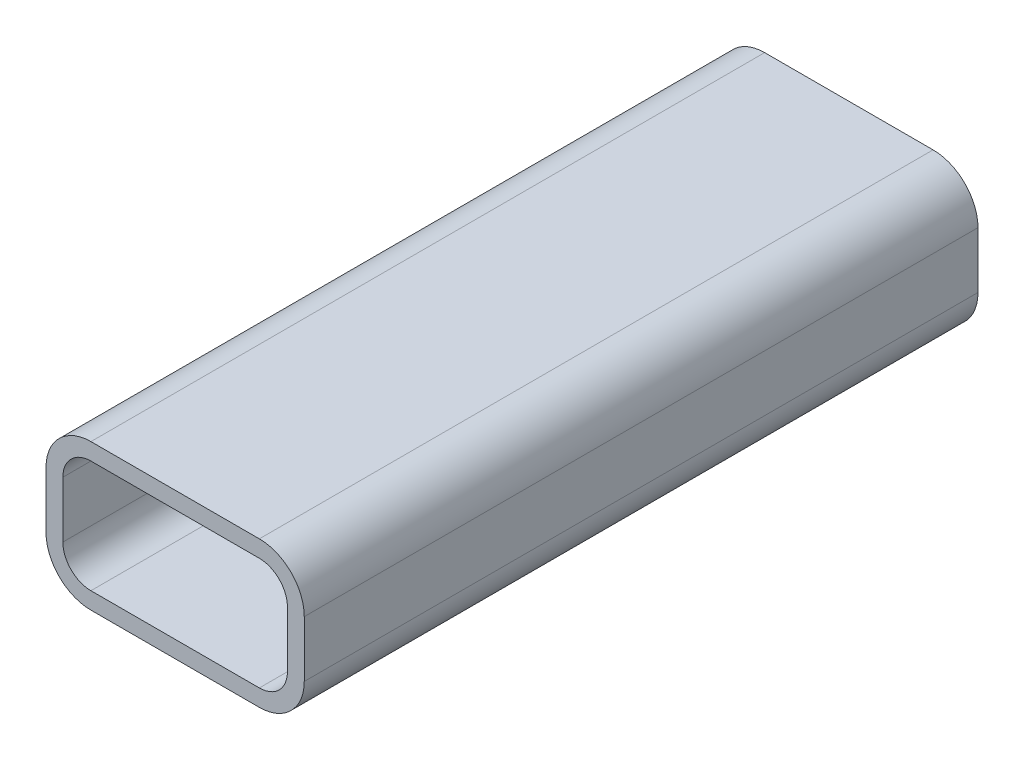
ISO-10303-21;
HEADER;
FILE_DESCRIPTION(('STEP AP214'),'2;1');
FILE_NAME('part.step','',(''),(''),'','','');
FILE_SCHEMA(('AUTOMOTIVE_DESIGN { 1 0 10303 214 1 1 1 1 }'));
ENDSEC;
DATA;
#1=APPLICATION_CONTEXT('core data for automotive mechanical design processes');
#2=APPLICATION_PROTOCOL_DEFINITION('international standard','automotive_design',2000,#1);
#3=PRODUCT_CONTEXT('',#1,'mechanical');
#4=PRODUCT('Part','Part','',(#3));
#5=PRODUCT_RELATED_PRODUCT_CATEGORY('part','',(#4));
#6=PRODUCT_DEFINITION_FORMATION('','',#4);
#7=PRODUCT_DEFINITION_CONTEXT('part definition',#1,'design');
#8=PRODUCT_DEFINITION('design','',#6,#7);
#9=PRODUCT_DEFINITION_SHAPE('','',#8);
#10=(LENGTH_UNIT() NAMED_UNIT(*) SI_UNIT(.MILLI.,.METRE.));
#11=(NAMED_UNIT(*) PLANE_ANGLE_UNIT() SI_UNIT($,.RADIAN.));
#12=(NAMED_UNIT(*) SI_UNIT($,.STERADIAN.) SOLID_ANGLE_UNIT());
#13=UNCERTAINTY_MEASURE_WITH_UNIT(LENGTH_MEASURE(1.E-05),#10,'distance_accuracy_value','');
#14=(GEOMETRIC_REPRESENTATION_CONTEXT(3) GLOBAL_UNCERTAINTY_ASSIGNED_CONTEXT((#13)) GLOBAL_UNIT_ASSIGNED_CONTEXT((#10,
#11,#12)) REPRESENTATION_CONTEXT('',''));
#15=CARTESIAN_POINT('',(0.,0.,0.));
#16=DIRECTION('',(0.,0.,1.));
#17=DIRECTION('',(1.,0.,0.));
#18=AXIS2_PLACEMENT_3D('',#15,#16,#17);
#19=CARTESIAN_POINT('',(24.0517051008152,-14.0517051008152,60.));
#20=DIRECTION('',(0.,0.,1.));
#21=DIRECTION('',(1.,0.,0.));
#22=AXIS2_PLACEMENT_3D('',#19,#20,#21);
#23=PLANE('',#22);
#24=CARTESIAN_POINT('',(24.0517051008152,-14.0517051008152,60.));
#25=DIRECTION('',(0.,0.,1.));
#26=DIRECTION('',(1.,0.,0.));
#27=AXIS2_PLACEMENT_3D('',#24,#25,#26);
#28=CIRCLE('',#27,7.99999999999999);
#29=CARTESIAN_POINT('',(24.0517051008152,-22.0517051008152,60.));
#30=VERTEX_POINT('',#29);
#31=CARTESIAN_POINT('',(32.0517051008152,-14.0517051008152,60.));
#32=VERTEX_POINT('',#31);
#33=EDGE_CURVE('E290',#30,#32,#28,.T.);
#34=ORIENTED_EDGE('',*,*,#33,.T.);
#35=DIRECTION('',(0.,1.,0.));
#36=VECTOR('',#35,1.);
#37=CARTESIAN_POINT('',(32.0517051008152,-4.05170510081523,60.));
#38=LINE('',#37,#36);
#39=CARTESIAN_POINT('',(32.0517051008152,-4.05170510081523,60.));
#40=VERTEX_POINT('',#39);
#41=EDGE_CURVE('E294',#32,#40,#38,.T.);
#42=ORIENTED_EDGE('',*,*,#41,.T.);
#43=CARTESIAN_POINT('',(24.0517051008152,-4.05170510081523,60.));
#44=DIRECTION('',(0.,0.,1.));
#45=DIRECTION('',(1.,0.,0.));
#46=AXIS2_PLACEMENT_3D('',#43,#44,#45);
#47=CIRCLE('',#46,8.);
#48=CARTESIAN_POINT('',(24.0517051008152,3.94829489918477,60.));
#49=VERTEX_POINT('',#48);
#50=EDGE_CURVE('E298',#40,#49,#47,.T.);
#51=ORIENTED_EDGE('',*,*,#50,.T.);
#52=DIRECTION('',(-1.,0.,0.));
#53=VECTOR('',#52,1.);
#54=CARTESIAN_POINT('',(-5.94829489918482,3.94829489918477,60.));
#55=LINE('',#54,#53);
#56=CARTESIAN_POINT('',(-5.94829489918482,3.94829489918477,60.));
#57=VERTEX_POINT('',#56);
#58=EDGE_CURVE('E301',#49,#57,#55,.T.);
#59=ORIENTED_EDGE('',*,*,#58,.T.);
#60=CARTESIAN_POINT('',(-5.94829489918482,-4.05170510081523,60.));
#61=DIRECTION('',(0.,0.,1.));
#62=DIRECTION('',(1.,0.,0.));
#63=AXIS2_PLACEMENT_3D('',#60,#61,#62);
#64=CIRCLE('',#63,8.);
#65=CARTESIAN_POINT('',(-13.9482948991848,-4.05170510081523,60.));
#66=VERTEX_POINT('',#65);
#67=EDGE_CURVE('E304',#57,#66,#64,.T.);
#68=ORIENTED_EDGE('',*,*,#67,.T.);
#69=DIRECTION('',(0.,-1.,0.));
#70=VECTOR('',#69,1.);
#71=CARTESIAN_POINT('',(-13.9482948991848,-4.05170510081523,60.));
#72=LINE('',#71,#70);
#73=CARTESIAN_POINT('',(-13.9482948991848,-14.0517051008152,60.));
#74=VERTEX_POINT('',#73);
#75=EDGE_CURVE('E307',#66,#74,#72,.T.);
#76=ORIENTED_EDGE('',*,*,#75,.T.);
#77=CARTESIAN_POINT('',(-5.94829489918482,-14.0517051008152,60.));
#78=DIRECTION('',(0.,0.,1.));
#79=DIRECTION('',(1.,0.,0.));
#80=AXIS2_PLACEMENT_3D('',#77,#78,#79);
#81=CIRCLE('',#80,8.);
#82=CARTESIAN_POINT('',(-5.94829489918482,-22.0517051008152,60.));
#83=VERTEX_POINT('',#82);
#84=EDGE_CURVE('E310',#74,#83,#81,.T.);
#85=ORIENTED_EDGE('',*,*,#84,.T.);
#86=DIRECTION('',(1.,0.,0.));
#87=VECTOR('',#86,1.);
#88=CARTESIAN_POINT('',(-5.94829489918482,-22.0517051008152,60.));
#89=LINE('',#88,#87);
#90=EDGE_CURVE('E313',#83,#30,#89,.T.);
#91=ORIENTED_EDGE('',*,*,#90,.T.);
#92=EDGE_LOOP('',(#34,#42,#51,#59,#68,#76,#85,#91));
#93=FACE_BOUND('',#92,.T.);
#94=DIRECTION('',(0.,1.,0.));
#95=VECTOR('',#94,1.);
#96=CARTESIAN_POINT('',(29.0517051008152,-4.05170510081523,60.));
#97=LINE('',#96,#95);
#98=CARTESIAN_POINT('',(29.0517051008152,-14.0517051008152,60.));
#99=VERTEX_POINT('',#98);
#100=CARTESIAN_POINT('',(29.0517051008152,-4.05170510081523,60.));
#101=VERTEX_POINT('',#100);
#102=EDGE_CURVE('E210',#99,#101,#97,.T.);
#103=ORIENTED_EDGE('',*,*,#102,.F.);
#104=CARTESIAN_POINT('',(24.0517051008152,-14.0517051008152,60.));
#105=DIRECTION('',(0.,0.,1.));
#106=DIRECTION('',(1.,0.,0.));
#107=AXIS2_PLACEMENT_3D('',#104,#105,#106);
#108=CIRCLE('',#107,4.99999999999999);
#109=CARTESIAN_POINT('',(24.0517051008152,-19.0517051008152,60.));
#110=VERTEX_POINT('',#109);
#111=EDGE_CURVE('E201',#110,#99,#108,.T.);
#112=ORIENTED_EDGE('',*,*,#111,.F.);
#113=DIRECTION('',(1.,0.,0.));
#114=VECTOR('',#113,1.);
#115=CARTESIAN_POINT('',(-5.94829489918482,-19.0517051008152,60.));
#116=LINE('',#115,#114);
#117=CARTESIAN_POINT('',(-5.94829489918481,-19.0517051008152,60.));
#118=VERTEX_POINT('',#117);
#119=EDGE_CURVE('E242',#118,#110,#116,.T.);
#120=ORIENTED_EDGE('',*,*,#119,.F.);
#121=CARTESIAN_POINT('',(-5.94829489918482,-14.0517051008152,60.));
#122=DIRECTION('',(0.,0.,1.));
#123=DIRECTION('',(1.,0.,0.));
#124=AXIS2_PLACEMENT_3D('',#121,#122,#123);
#125=CIRCLE('',#124,5.);
#126=CARTESIAN_POINT('',(-10.9482948991848,-14.0517051008152,60.));
#127=VERTEX_POINT('',#126);
#128=EDGE_CURVE('E239',#127,#118,#125,.T.);
#129=ORIENTED_EDGE('',*,*,#128,.F.);
#130=DIRECTION('',(0.,-1.,0.));
#131=VECTOR('',#130,1.);
#132=CARTESIAN_POINT('',(-10.9482948991848,-4.05170510081523,60.));
#133=LINE('',#132,#131);
#134=CARTESIAN_POINT('',(-10.9482948991848,-4.05170510081523,60.));
#135=VERTEX_POINT('',#134);
#136=EDGE_CURVE('E236',#135,#127,#133,.T.);
#137=ORIENTED_EDGE('',*,*,#136,.F.);
#138=CARTESIAN_POINT('',(-5.94829489918482,-4.05170510081523,60.));
#139=DIRECTION('',(0.,0.,1.));
#140=DIRECTION('',(1.,0.,0.));
#141=AXIS2_PLACEMENT_3D('',#138,#139,#140);
#142=CIRCLE('',#141,5.);
#143=CARTESIAN_POINT('',(-5.94829489918482,0.948294899184767,60.));
#144=VERTEX_POINT('',#143);
#145=EDGE_CURVE('E233',#144,#135,#142,.T.);
#146=ORIENTED_EDGE('',*,*,#145,.F.);
#147=DIRECTION('',(-1.,0.,0.));
#148=VECTOR('',#147,1.);
#149=CARTESIAN_POINT('',(-5.94829489918482,0.948294899184767,60.));
#150=LINE('',#149,#148);
#151=CARTESIAN_POINT('',(24.0517051008152,0.948294899184767,60.));
#152=VERTEX_POINT('',#151);
#153=EDGE_CURVE('E228',#152,#144,#150,.T.);
#154=ORIENTED_EDGE('',*,*,#153,.F.);
#155=CARTESIAN_POINT('',(24.0517051008152,-4.05170510081523,60.));
#156=DIRECTION('',(0.,0.,1.));
#157=DIRECTION('',(-1.,0.,0.));
#158=AXIS2_PLACEMENT_3D('',#155,#156,#157);
#159=CIRCLE('',#158,5.);
#160=EDGE_CURVE('E224',#101,#152,#159,.T.);
#161=ORIENTED_EDGE('',*,*,#160,.F.);
#162=EDGE_LOOP('',(#103,#112,#120,#129,#137,#146,#154,#161));
#163=FACE_BOUND('',#162,.T.);
#164=ADVANCED_FACE('F87',(#93,#163),#23,.T.);
#165=CARTESIAN_POINT('',(24.0517051008152,-14.0517051008152,-60.));
#166=DIRECTION('',(0.,0.,1.));
#167=DIRECTION('',(1.,0.,0.));
#168=AXIS2_PLACEMENT_3D('',#165,#166,#167);
#169=PLANE('',#168);
#170=CARTESIAN_POINT('',(24.0517051008152,-14.0517051008152,-60.));
#171=DIRECTION('',(0.,0.,1.));
#172=DIRECTION('',(1.,0.,0.));
#173=AXIS2_PLACEMENT_3D('',#170,#171,#172);
#174=CIRCLE('',#173,7.99999999999999);
#175=CARTESIAN_POINT('',(24.0517051008152,-22.0517051008152,-60.));
#176=VERTEX_POINT('',#175);
#177=CARTESIAN_POINT('',(32.0517051008152,-14.0517051008152,-60.));
#178=VERTEX_POINT('',#177);
#179=EDGE_CURVE('E219',#176,#178,#174,.T.);
#180=ORIENTED_EDGE('',*,*,#179,.F.);
#181=DIRECTION('',(1.,0.,0.));
#182=VECTOR('',#181,1.);
#183=CARTESIAN_POINT('',(-5.94829489918482,-22.0517051008152,-60.));
#184=LINE('',#183,#182);
#185=CARTESIAN_POINT('',(-5.94829489918482,-22.0517051008152,-60.));
#186=VERTEX_POINT('',#185);
#187=EDGE_CURVE('E295',#186,#176,#184,.T.);
#188=ORIENTED_EDGE('',*,*,#187,.F.);
#189=CARTESIAN_POINT('',(-5.94829489918482,-14.0517051008152,-60.));
#190=DIRECTION('',(0.,0.,1.));
#191=DIRECTION('',(1.,0.,0.));
#192=AXIS2_PLACEMENT_3D('',#189,#190,#191);
#193=CIRCLE('',#192,8.);
#194=CARTESIAN_POINT('',(-13.9482948991848,-14.0517051008152,-60.));
#195=VERTEX_POINT('',#194);
#196=EDGE_CURVE('E335',#195,#186,#193,.T.);
#197=ORIENTED_EDGE('',*,*,#196,.F.);
#198=DIRECTION('',(0.,-1.,0.));
#199=VECTOR('',#198,1.);
#200=CARTESIAN_POINT('',(-13.9482948991848,-4.05170510081523,-60.));
#201=LINE('',#200,#199);
#202=CARTESIAN_POINT('',(-13.9482948991848,-4.05170510081523,-60.));
#203=VERTEX_POINT('',#202);
#204=EDGE_CURVE('E332',#203,#195,#201,.T.);
#205=ORIENTED_EDGE('',*,*,#204,.F.);
#206=CARTESIAN_POINT('',(-5.94829489918482,-4.05170510081523,-60.));
#207=DIRECTION('',(0.,0.,1.));
#208=DIRECTION('',(1.,0.,0.));
#209=AXIS2_PLACEMENT_3D('',#206,#207,#208);
#210=CIRCLE('',#209,8.);
#211=CARTESIAN_POINT('',(-5.94829489918482,3.94829489918477,-60.));
#212=VERTEX_POINT('',#211);
#213=EDGE_CURVE('E329',#212,#203,#210,.T.);
#214=ORIENTED_EDGE('',*,*,#213,.F.);
#215=DIRECTION('',(-1.,0.,0.));
#216=VECTOR('',#215,1.);
#217=CARTESIAN_POINT('',(-5.94829489918482,3.94829489918477,-60.));
#218=LINE('',#217,#216);
#219=CARTESIAN_POINT('',(24.0517051008152,3.94829489918477,-60.));
#220=VERTEX_POINT('',#219);
#221=EDGE_CURVE('E326',#220,#212,#218,.T.);
#222=ORIENTED_EDGE('',*,*,#221,.F.);
#223=CARTESIAN_POINT('',(24.0517051008152,-4.05170510081523,-60.));
#224=DIRECTION('',(0.,0.,1.));
#225=DIRECTION('',(1.,0.,0.));
#226=AXIS2_PLACEMENT_3D('',#223,#224,#225);
#227=CIRCLE('',#226,8.);
#228=CARTESIAN_POINT('',(32.0517051008152,-4.05170510081523,-60.));
#229=VERTEX_POINT('',#228);
#230=EDGE_CURVE('E323',#229,#220,#227,.T.);
#231=ORIENTED_EDGE('',*,*,#230,.F.);
#232=DIRECTION('',(0.,1.,0.));
#233=VECTOR('',#232,1.);
#234=CARTESIAN_POINT('',(32.0517051008152,-4.05170510081523,-60.));
#235=LINE('',#234,#233);
#236=EDGE_CURVE('E320',#178,#229,#235,.T.);
#237=ORIENTED_EDGE('',*,*,#236,.F.);
#238=EDGE_LOOP('',(#180,#188,#197,#205,#214,#222,#231,#237));
#239=FACE_BOUND('',#238,.T.);
#240=CARTESIAN_POINT('',(24.0517051008152,-14.0517051008152,-60.));
#241=DIRECTION('',(0.,0.,1.));
#242=DIRECTION('',(1.,0.,0.));
#243=AXIS2_PLACEMENT_3D('',#240,#241,#242);
#244=CIRCLE('',#243,4.99999999999999);
#245=CARTESIAN_POINT('',(24.0517051008152,-19.0517051008152,-60.));
#246=VERTEX_POINT('',#245);
#247=CARTESIAN_POINT('',(29.0517051008152,-14.0517051008152,-60.));
#248=VERTEX_POINT('',#247);
#249=EDGE_CURVE('E111',#246,#248,#244,.T.);
#250=ORIENTED_EDGE('',*,*,#249,.T.);
#251=DIRECTION('',(0.,1.,0.));
#252=VECTOR('',#251,1.);
#253=CARTESIAN_POINT('',(29.0517051008152,-4.05170510081523,-60.));
#254=LINE('',#253,#252);
#255=CARTESIAN_POINT('',(29.0517051008152,-4.05170510081523,-60.));
#256=VERTEX_POINT('',#255);
#257=EDGE_CURVE('E217',#248,#256,#254,.T.);
#258=ORIENTED_EDGE('',*,*,#257,.T.);
#259=CARTESIAN_POINT('',(24.0517051008152,-4.05170510081523,-60.));
#260=DIRECTION('',(0.,0.,1.));
#261=DIRECTION('',(-1.,0.,0.));
#262=AXIS2_PLACEMENT_3D('',#259,#260,#261);
#263=CIRCLE('',#262,5.);
#264=CARTESIAN_POINT('',(24.0517051008152,0.948294899184767,-60.));
#265=VERTEX_POINT('',#264);
#266=EDGE_CURVE('E249',#256,#265,#263,.T.);
#267=ORIENTED_EDGE('',*,*,#266,.T.);
#268=DIRECTION('',(-1.,0.,0.));
#269=VECTOR('',#268,1.);
#270=CARTESIAN_POINT('',(-5.94829489918482,0.948294899184767,-60.));
#271=LINE('',#270,#269);
#272=CARTESIAN_POINT('',(-5.94829489918482,0.948294899184767,-60.));
#273=VERTEX_POINT('',#272);
#274=EDGE_CURVE('E253',#265,#273,#271,.T.);
#275=ORIENTED_EDGE('',*,*,#274,.T.);
#276=CARTESIAN_POINT('',(-5.94829489918482,-4.05170510081523,-60.));
#277=DIRECTION('',(0.,0.,1.));
#278=DIRECTION('',(1.,0.,0.));
#279=AXIS2_PLACEMENT_3D('',#276,#277,#278);
#280=CIRCLE('',#279,5.);
#281=CARTESIAN_POINT('',(-10.9482948991848,-4.05170510081523,-60.));
#282=VERTEX_POINT('',#281);
#283=EDGE_CURVE('E257',#273,#282,#280,.T.);
#284=ORIENTED_EDGE('',*,*,#283,.T.);
#285=DIRECTION('',(0.,-1.,0.));
#286=VECTOR('',#285,1.);
#287=CARTESIAN_POINT('',(-10.9482948991848,-4.05170510081523,-60.));
#288=LINE('',#287,#286);
#289=CARTESIAN_POINT('',(-10.9482948991848,-14.0517051008152,-60.));
#290=VERTEX_POINT('',#289);
#291=EDGE_CURVE('E261',#282,#290,#288,.T.);
#292=ORIENTED_EDGE('',*,*,#291,.T.);
#293=CARTESIAN_POINT('',(-5.94829489918482,-14.0517051008152,-60.));
#294=DIRECTION('',(0.,0.,1.));
#295=DIRECTION('',(1.,0.,0.));
#296=AXIS2_PLACEMENT_3D('',#293,#294,#295);
#297=CIRCLE('',#296,5.);
#298=CARTESIAN_POINT('',(-5.94829489918482,-19.0517051008152,-60.));
#299=VERTEX_POINT('',#298);
#300=EDGE_CURVE('E265',#290,#299,#297,.T.);
#301=ORIENTED_EDGE('',*,*,#300,.T.);
#302=DIRECTION('',(1.,0.,0.));
#303=VECTOR('',#302,1.);
#304=CARTESIAN_POINT('',(-5.94829489918482,-19.0517051008152,-60.));
#305=LINE('',#304,#303);
#306=EDGE_CURVE('E211',#299,#246,#305,.T.);
#307=ORIENTED_EDGE('',*,*,#306,.T.);
#308=EDGE_LOOP('',(#250,#258,#267,#275,#284,#292,#301,#307));
#309=FACE_BOUND('',#308,.T.);
#310=ADVANCED_FACE('F374',(#239,#309),#169,.F.);
#311=CARTESIAN_POINT('',(24.0517051008152,-14.0517051008152,60.));
#312=DIRECTION('',(0.,0.,-1.));
#313=DIRECTION('',(-1.,0.,0.));
#314=AXIS2_PLACEMENT_3D('',#311,#312,#313);
#315=CYLINDRICAL_SURFACE('',#314,7.99999999999999);
#316=ORIENTED_EDGE('',*,*,#179,.T.);
#317=DIRECTION('',(0.,0.,-1.));
#318=VECTOR('',#317,1.);
#319=CARTESIAN_POINT('',(32.0517051008152,-14.0517051008152,60.));
#320=LINE('',#319,#318);
#321=EDGE_CURVE('E12',#32,#178,#320,.T.);
#322=ORIENTED_EDGE('',*,*,#321,.F.);
#323=ORIENTED_EDGE('',*,*,#33,.F.);
#324=DIRECTION('',(0.,0.,-1.));
#325=VECTOR('',#324,1.);
#326=CARTESIAN_POINT('',(24.0517051008152,-22.0517051008152,60.));
#327=LINE('',#326,#325);
#328=EDGE_CURVE('E316',#30,#176,#327,.T.);
#329=ORIENTED_EDGE('',*,*,#328,.T.);
#330=EDGE_LOOP('',(#316,#322,#323,#329));
#331=FACE_BOUND('',#330,.T.);
#332=ADVANCED_FACE('F89',(#331),#315,.T.);
#333=CARTESIAN_POINT('',(32.0517051008152,-4.05170510081523,60.));
#334=DIRECTION('',(-1.,0.,0.));
#335=DIRECTION('',(0.,-1.,0.));
#336=AXIS2_PLACEMENT_3D('',#333,#334,#335);
#337=PLANE('',#336);
#338=ORIENTED_EDGE('',*,*,#236,.T.);
#339=DIRECTION('',(0.,0.,-1.));
#340=VECTOR('',#339,1.);
#341=CARTESIAN_POINT('',(32.0517051008152,-4.05170510081523,60.));
#342=LINE('',#341,#340);
#343=EDGE_CURVE('E96',#40,#229,#342,.T.);
#344=ORIENTED_EDGE('',*,*,#343,.F.);
#345=ORIENTED_EDGE('',*,*,#41,.F.);
#346=ORIENTED_EDGE('',*,*,#321,.T.);
#347=EDGE_LOOP('',(#338,#344,#345,#346));
#348=FACE_BOUND('',#347,.T.);
#349=ADVANCED_FACE('F391',(#348),#337,.F.);
#350=CARTESIAN_POINT('',(24.0517051008152,-4.05170510081523,60.));
#351=DIRECTION('',(0.,0.,-1.));
#352=DIRECTION('',(-1.,0.,0.));
#353=AXIS2_PLACEMENT_3D('',#350,#351,#352);
#354=CYLINDRICAL_SURFACE('',#353,8.);
#355=ORIENTED_EDGE('',*,*,#230,.T.);
#356=DIRECTION('',(0.,0.,-1.));
#357=VECTOR('',#356,1.);
#358=CARTESIAN_POINT('',(24.0517051008152,3.94829489918477,60.));
#359=LINE('',#358,#357);
#360=EDGE_CURVE('E359',#49,#220,#359,.T.);
#361=ORIENTED_EDGE('',*,*,#360,.F.);
#362=ORIENTED_EDGE('',*,*,#50,.F.);
#363=ORIENTED_EDGE('',*,*,#343,.T.);
#364=EDGE_LOOP('',(#355,#361,#362,#363));
#365=FACE_BOUND('',#364,.T.);
#366=ADVANCED_FACE('F368',(#365),#354,.T.);
#367=CARTESIAN_POINT('',(-5.94829489918482,3.94829489918477,60.));
#368=DIRECTION('',(0.,-1.,0.));
#369=DIRECTION('',(0.,0.,-1.));
#370=AXIS2_PLACEMENT_3D('',#367,#368,#369);
#371=PLANE('',#370);
#372=ORIENTED_EDGE('',*,*,#221,.T.);
#373=DIRECTION('',(0.,0.,-1.));
#374=VECTOR('',#373,1.);
#375=CARTESIAN_POINT('',(-5.94829489918482,3.94829489918477,60.));
#376=LINE('',#375,#374);
#377=EDGE_CURVE('E355',#57,#212,#376,.T.);
#378=ORIENTED_EDGE('',*,*,#377,.F.);
#379=ORIENTED_EDGE('',*,*,#58,.F.);
#380=ORIENTED_EDGE('',*,*,#360,.T.);
#381=EDGE_LOOP('',(#372,#378,#379,#380));
#382=FACE_BOUND('',#381,.T.);
#383=ADVANCED_FACE('F380',(#382),#371,.F.);
#384=CARTESIAN_POINT('',(-5.94829489918482,-4.05170510081523,60.));
#385=DIRECTION('',(0.,0.,-1.));
#386=DIRECTION('',(-1.,0.,0.));
#387=AXIS2_PLACEMENT_3D('',#384,#385,#386);
#388=CYLINDRICAL_SURFACE('',#387,8.);
#389=ORIENTED_EDGE('',*,*,#213,.T.);
#390=DIRECTION('',(0.,0.,-1.));
#391=VECTOR('',#390,1.);
#392=CARTESIAN_POINT('',(-13.9482948991848,-4.05170510081523,60.));
#393=LINE('',#392,#391);
#394=EDGE_CURVE('E351',#66,#203,#393,.T.);
#395=ORIENTED_EDGE('',*,*,#394,.F.);
#396=ORIENTED_EDGE('',*,*,#67,.F.);
#397=ORIENTED_EDGE('',*,*,#377,.T.);
#398=EDGE_LOOP('',(#389,#395,#396,#397));
#399=FACE_BOUND('',#398,.T.);
#400=ADVANCED_FACE('F384',(#399),#388,.T.);
#401=CARTESIAN_POINT('',(-13.9482948991848,-4.05170510081523,60.));
#402=DIRECTION('',(1.,0.,0.));
#403=DIRECTION('',(0.,1.,0.));
#404=AXIS2_PLACEMENT_3D('',#401,#402,#403);
#405=PLANE('',#404);
#406=ORIENTED_EDGE('',*,*,#204,.T.);
#407=DIRECTION('',(0.,0.,-1.));
#408=VECTOR('',#407,1.);
#409=CARTESIAN_POINT('',(-13.9482948991848,-14.0517051008152,60.));
#410=LINE('',#409,#408);
#411=EDGE_CURVE('E347',#74,#195,#410,.T.);
#412=ORIENTED_EDGE('',*,*,#411,.F.);
#413=ORIENTED_EDGE('',*,*,#75,.F.);
#414=ORIENTED_EDGE('',*,*,#394,.T.);
#415=EDGE_LOOP('',(#406,#412,#413,#414));
#416=FACE_BOUND('',#415,.T.);
#417=ADVANCED_FACE('F404',(#416),#405,.F.);
#418=CARTESIAN_POINT('',(-5.94829489918482,-14.0517051008152,60.));
#419=DIRECTION('',(0.,0.,-1.));
#420=DIRECTION('',(-1.,0.,0.));
#421=AXIS2_PLACEMENT_3D('',#418,#419,#420);
#422=CYLINDRICAL_SURFACE('',#421,8.);
#423=ORIENTED_EDGE('',*,*,#196,.T.);
#424=DIRECTION('',(0.,0.,-1.));
#425=VECTOR('',#424,1.);
#426=CARTESIAN_POINT('',(-5.94829489918482,-22.0517051008152,60.));
#427=LINE('',#426,#425);
#428=EDGE_CURVE('E343',#83,#186,#427,.T.);
#429=ORIENTED_EDGE('',*,*,#428,.F.);
#430=ORIENTED_EDGE('',*,*,#84,.F.);
#431=ORIENTED_EDGE('',*,*,#411,.T.);
#432=EDGE_LOOP('',(#423,#429,#430,#431));
#433=FACE_BOUND('',#432,.T.);
#434=ADVANCED_FACE('F402',(#433),#422,.T.);
#435=CARTESIAN_POINT('',(-5.94829489918482,-22.0517051008152,60.));
#436=DIRECTION('',(0.,1.,0.));
#437=DIRECTION('',(-1.,0.,0.));
#438=AXIS2_PLACEMENT_3D('',#435,#436,#437);
#439=PLANE('',#438);
#440=ORIENTED_EDGE('',*,*,#187,.T.);
#441=ORIENTED_EDGE('',*,*,#328,.F.);
#442=ORIENTED_EDGE('',*,*,#90,.F.);
#443=ORIENTED_EDGE('',*,*,#428,.T.);
#444=EDGE_LOOP('',(#440,#441,#442,#443));
#445=FACE_BOUND('',#444,.T.);
#446=ADVANCED_FACE('F397',(#445),#439,.F.);
#447=CARTESIAN_POINT('',(24.0517051008152,-14.0517051008152,60.));
#448=DIRECTION('',(0.,0.,-1.));
#449=DIRECTION('',(-1.,0.,0.));
#450=AXIS2_PLACEMENT_3D('',#447,#448,#449);
#451=CYLINDRICAL_SURFACE('',#450,4.99999999999999);
#452=ORIENTED_EDGE('',*,*,#249,.F.);
#453=DIRECTION('',(0.,0.,-1.));
#454=VECTOR('',#453,1.);
#455=CARTESIAN_POINT('',(24.0517051008152,-19.0517051008152,60.));
#456=LINE('',#455,#454);
#457=EDGE_CURVE('E205',#110,#246,#456,.T.);
#458=ORIENTED_EDGE('',*,*,#457,.F.);
#459=ORIENTED_EDGE('',*,*,#111,.T.);
#460=DIRECTION('',(0.,0.,-1.));
#461=VECTOR('',#460,1.);
#462=CARTESIAN_POINT('',(29.0517051008152,-14.0517051008152,60.));
#463=LINE('',#462,#461);
#464=EDGE_CURVE('E204',#99,#248,#463,.T.);
#465=ORIENTED_EDGE('',*,*,#464,.T.);
#466=EDGE_LOOP('',(#452,#458,#459,#465));
#467=FACE_BOUND('',#466,.T.);
#468=ADVANCED_FACE('F203',(#467),#451,.F.);
#469=CARTESIAN_POINT('',(29.0517051008152,-4.05170510081523,60.));
#470=DIRECTION('',(-1.,0.,0.));
#471=DIRECTION('',(0.,-1.,0.));
#472=AXIS2_PLACEMENT_3D('',#469,#470,#471);
#473=PLANE('',#472);
#474=ORIENTED_EDGE('',*,*,#257,.F.);
#475=ORIENTED_EDGE('',*,*,#464,.F.);
#476=ORIENTED_EDGE('',*,*,#102,.T.);
#477=DIRECTION('',(0.,0.,-1.));
#478=VECTOR('',#477,1.);
#479=CARTESIAN_POINT('',(29.0517051008152,-4.05170510081523,60.));
#480=LINE('',#479,#478);
#481=EDGE_CURVE('E220',#101,#256,#480,.T.);
#482=ORIENTED_EDGE('',*,*,#481,.T.);
#483=EDGE_LOOP('',(#474,#475,#476,#482));
#484=FACE_BOUND('',#483,.T.);
#485=ADVANCED_FACE('F214',(#484),#473,.T.);
#486=CARTESIAN_POINT('',(24.0517051008152,-4.05170510081523,60.));
#487=DIRECTION('',(0.,0.,-1.));
#488=DIRECTION('',(-1.,0.,0.));
#489=AXIS2_PLACEMENT_3D('',#486,#487,#488);
#490=CYLINDRICAL_SURFACE('',#489,5.);
#491=ORIENTED_EDGE('',*,*,#266,.F.);
#492=ORIENTED_EDGE('',*,*,#481,.F.);
#493=ORIENTED_EDGE('',*,*,#160,.T.);
#494=DIRECTION('',(0.,0.,-1.));
#495=VECTOR('',#494,1.);
#496=CARTESIAN_POINT('',(24.0517051008152,0.948294899184767,60.));
#497=LINE('',#496,#495);
#498=EDGE_CURVE('E285',#152,#265,#497,.T.);
#499=ORIENTED_EDGE('',*,*,#498,.T.);
#500=EDGE_LOOP('',(#491,#492,#493,#499));
#501=FACE_BOUND('',#500,.T.);
#502=ADVANCED_FACE('F429',(#501),#490,.F.);
#503=CARTESIAN_POINT('',(-5.94829489918482,0.948294899184767,60.));
#504=DIRECTION('',(0.,-1.,0.));
#505=DIRECTION('',(0.,0.,-1.));
#506=AXIS2_PLACEMENT_3D('',#503,#504,#505);
#507=PLANE('',#506);
#508=ORIENTED_EDGE('',*,*,#274,.F.);
#509=ORIENTED_EDGE('',*,*,#498,.F.);
#510=ORIENTED_EDGE('',*,*,#153,.T.);
#511=DIRECTION('',(0.,0.,-1.));
#512=VECTOR('',#511,1.);
#513=CARTESIAN_POINT('',(-5.94829489918482,0.948294899184767,60.));
#514=LINE('',#513,#512);
#515=EDGE_CURVE('E282',#144,#273,#514,.T.);
#516=ORIENTED_EDGE('',*,*,#515,.T.);
#517=EDGE_LOOP('',(#508,#509,#510,#516));
#518=FACE_BOUND('',#517,.T.);
#519=ADVANCED_FACE('F433',(#518),#507,.T.);
#520=CARTESIAN_POINT('',(-5.94829489918482,-4.05170510081523,60.));
#521=DIRECTION('',(0.,0.,-1.));
#522=DIRECTION('',(-1.,0.,0.));
#523=AXIS2_PLACEMENT_3D('',#520,#521,#522);
#524=CYLINDRICAL_SURFACE('',#523,5.);
#525=ORIENTED_EDGE('',*,*,#283,.F.);
#526=ORIENTED_EDGE('',*,*,#515,.F.);
#527=ORIENTED_EDGE('',*,*,#145,.T.);
#528=DIRECTION('',(0.,0.,-1.));
#529=VECTOR('',#528,1.);
#530=CARTESIAN_POINT('',(-10.9482948991848,-4.05170510081523,60.));
#531=LINE('',#530,#529);
#532=EDGE_CURVE('E279',#135,#282,#531,.T.);
#533=ORIENTED_EDGE('',*,*,#532,.T.);
#534=EDGE_LOOP('',(#525,#526,#527,#533));
#535=FACE_BOUND('',#534,.T.);
#536=ADVANCED_FACE('F439',(#535),#524,.F.);
#537=CARTESIAN_POINT('',(-10.9482948991848,-4.05170510081523,60.));
#538=DIRECTION('',(1.,0.,0.));
#539=DIRECTION('',(0.,1.,0.));
#540=AXIS2_PLACEMENT_3D('',#537,#538,#539);
#541=PLANE('',#540);
#542=ORIENTED_EDGE('',*,*,#291,.F.);
#543=ORIENTED_EDGE('',*,*,#532,.F.);
#544=ORIENTED_EDGE('',*,*,#136,.T.);
#545=DIRECTION('',(0.,0.,-1.));
#546=VECTOR('',#545,1.);
#547=CARTESIAN_POINT('',(-10.9482948991848,-14.0517051008152,60.));
#548=LINE('',#547,#546);
#549=EDGE_CURVE('E276',#127,#290,#548,.T.);
#550=ORIENTED_EDGE('',*,*,#549,.T.);
#551=EDGE_LOOP('',(#542,#543,#544,#550));
#552=FACE_BOUND('',#551,.T.);
#553=ADVANCED_FACE('F443',(#552),#541,.T.);
#554=CARTESIAN_POINT('',(-5.94829489918482,-14.0517051008152,60.));
#555=DIRECTION('',(0.,0.,-1.));
#556=DIRECTION('',(-1.,0.,0.));
#557=AXIS2_PLACEMENT_3D('',#554,#555,#556);
#558=CYLINDRICAL_SURFACE('',#557,5.);
#559=ORIENTED_EDGE('',*,*,#300,.F.);
#560=ORIENTED_EDGE('',*,*,#549,.F.);
#561=ORIENTED_EDGE('',*,*,#128,.T.);
#562=DIRECTION('',(0.,0.,-1.));
#563=VECTOR('',#562,1.);
#564=CARTESIAN_POINT('',(-5.94829489918482,-19.0517051008152,60.));
#565=LINE('',#564,#563);
#566=EDGE_CURVE('E103',#118,#299,#565,.T.);
#567=ORIENTED_EDGE('',*,*,#566,.T.);
#568=EDGE_LOOP('',(#559,#560,#561,#567));
#569=FACE_BOUND('',#568,.T.);
#570=ADVANCED_FACE('F447',(#569),#558,.F.);
#571=CARTESIAN_POINT('',(-5.94829489918482,-19.0517051008152,60.));
#572=DIRECTION('',(0.,1.,0.));
#573=DIRECTION('',(-1.,0.,0.));
#574=AXIS2_PLACEMENT_3D('',#571,#572,#573);
#575=PLANE('',#574);
#576=ORIENTED_EDGE('',*,*,#306,.F.);
#577=ORIENTED_EDGE('',*,*,#566,.F.);
#578=ORIENTED_EDGE('',*,*,#119,.T.);
#579=ORIENTED_EDGE('',*,*,#457,.T.);
#580=EDGE_LOOP('',(#576,#577,#578,#579));
#581=FACE_BOUND('',#580,.T.);
#582=ADVANCED_FACE('F451',(#581),#575,.T.);
#583=CLOSED_SHELL('',(#164,#310,#332,#349,#366,#383,#400,#417,#434,#446,#468,#485,#502,#519,
#536,#553,#570,#582));
#584=MANIFOLD_SOLID_BREP('B2',#583);
#585=ADVANCED_BREP_SHAPE_REPRESENTATION('',(#18,#584),#14);
#586=SHAPE_DEFINITION_REPRESENTATION(#9,#585);
ENDSEC;
END-ISO-10303-21;
